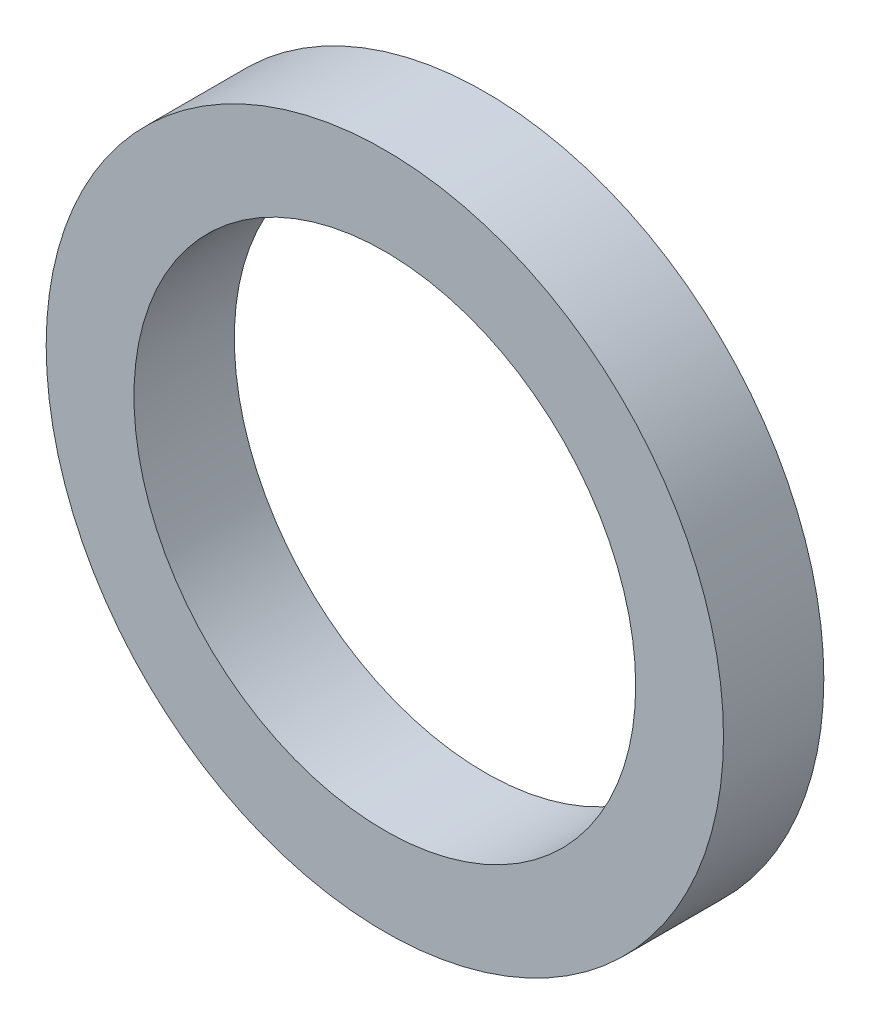
ISO-10303-21;
HEADER;
FILE_DESCRIPTION(('STEP AP214'),'2;1');
FILE_NAME('part.step','',(''),(''),'','','');
FILE_SCHEMA(('AUTOMOTIVE_DESIGN { 1 0 10303 214 1 1 1 1 }'));
ENDSEC;
DATA;
#1=APPLICATION_CONTEXT('core data for automotive mechanical design processes');
#2=APPLICATION_PROTOCOL_DEFINITION('international standard','automotive_design',2000,#1);
#3=PRODUCT_CONTEXT('',#1,'mechanical');
#4=PRODUCT('Part','Part','',(#3));
#5=PRODUCT_RELATED_PRODUCT_CATEGORY('part','',(#4));
#6=PRODUCT_DEFINITION_FORMATION('','',#4);
#7=PRODUCT_DEFINITION_CONTEXT('part definition',#1,'design');
#8=PRODUCT_DEFINITION('design','',#6,#7);
#9=PRODUCT_DEFINITION_SHAPE('','',#8);
#10=(LENGTH_UNIT() NAMED_UNIT(*) SI_UNIT(.MILLI.,.METRE.));
#11=(NAMED_UNIT(*) PLANE_ANGLE_UNIT() SI_UNIT($,.RADIAN.));
#12=(NAMED_UNIT(*) SI_UNIT($,.STERADIAN.) SOLID_ANGLE_UNIT());
#13=UNCERTAINTY_MEASURE_WITH_UNIT(LENGTH_MEASURE(1.E-05),#10,'distance_accuracy_value','');
#14=(GEOMETRIC_REPRESENTATION_CONTEXT(3) GLOBAL_UNCERTAINTY_ASSIGNED_CONTEXT((#13)) GLOBAL_UNIT_ASSIGNED_CONTEXT((#10,
#11,#12)) REPRESENTATION_CONTEXT('',''));
#15=CARTESIAN_POINT('',(0.,0.,0.));
#16=DIRECTION('',(0.,0.,1.));
#17=DIRECTION('',(1.,0.,0.));
#18=AXIS2_PLACEMENT_3D('',#15,#16,#17);
#19=CARTESIAN_POINT('',(0.,0.,4.));
#20=DIRECTION('',(0.,0.,1.));
#21=DIRECTION('',(1.,0.,0.));
#22=AXIS2_PLACEMENT_3D('',#19,#20,#21);
#23=PLANE('',#22);
#24=CARTESIAN_POINT('',(0.,0.,4.));
#25=DIRECTION('',(0.,0.,1.));
#26=DIRECTION('',(1.,0.,0.));
#27=AXIS2_PLACEMENT_3D('',#24,#25,#26);
#28=CIRCLE('',#27,13.5);
#29=CARTESIAN_POINT('',(13.5,0.,4.));
#30=VERTEX_POINT('',#29);
#31=EDGE_CURVE('E10',#30,#30,#28,.T.);
#32=ORIENTED_EDGE('',*,*,#31,.T.);
#33=EDGE_LOOP('',(#32));
#34=FACE_BOUND('',#33,.T.);
#35=CARTESIAN_POINT('',(0.,0.,4.));
#36=DIRECTION('',(0.,0.,1.));
#37=DIRECTION('',(1.,0.,0.));
#38=AXIS2_PLACEMENT_3D('',#35,#36,#37);
#39=CIRCLE('',#38,10.);
#40=CARTESIAN_POINT('',(10.,0.,4.));
#41=VERTEX_POINT('',#40);
#42=EDGE_CURVE('E50',#41,#41,#39,.T.);
#43=ORIENTED_EDGE('',*,*,#42,.F.);
#44=EDGE_LOOP('',(#43));
#45=FACE_BOUND('',#44,.T.);
#46=ADVANCED_FACE('F37',(#34,#45),#23,.T.);
#47=CARTESIAN_POINT('',(0.,0.,0.));
#48=DIRECTION('',(0.,0.,1.));
#49=DIRECTION('',(1.,0.,0.));
#50=AXIS2_PLACEMENT_3D('',#47,#48,#49);
#51=PLANE('',#50);
#52=CARTESIAN_POINT('',(0.,0.,0.));
#53=DIRECTION('',(0.,0.,1.));
#54=DIRECTION('',(1.,0.,0.));
#55=AXIS2_PLACEMENT_3D('',#52,#53,#54);
#56=CIRCLE('',#55,13.5);
#57=CARTESIAN_POINT('',(13.5,0.,0.));
#58=VERTEX_POINT('',#57);
#59=EDGE_CURVE('E41',#58,#58,#56,.T.);
#60=ORIENTED_EDGE('',*,*,#59,.F.);
#61=EDGE_LOOP('',(#60));
#62=FACE_BOUND('',#61,.T.);
#63=CARTESIAN_POINT('',(0.,0.,0.));
#64=DIRECTION('',(0.,0.,1.));
#65=DIRECTION('',(1.,0.,0.));
#66=AXIS2_PLACEMENT_3D('',#63,#64,#65);
#67=CIRCLE('',#66,10.);
#68=CARTESIAN_POINT('',(10.,0.,0.));
#69=VERTEX_POINT('',#68);
#70=EDGE_CURVE('E52',#69,#69,#67,.T.);
#71=ORIENTED_EDGE('',*,*,#70,.T.);
#72=EDGE_LOOP('',(#71));
#73=FACE_BOUND('',#72,.T.);
#74=ADVANCED_FACE('F64',(#62,#73),#51,.F.);
#75=CARTESIAN_POINT('',(0.,0.,4.));
#76=DIRECTION('',(0.,0.,-1.));
#77=DIRECTION('',(-1.,0.,0.));
#78=AXIS2_PLACEMENT_3D('',#75,#76,#77);
#79=CYLINDRICAL_SURFACE('',#78,13.5);
#80=ORIENTED_EDGE('',*,*,#31,.F.);
#81=EDGE_LOOP('',(#80));
#82=FACE_BOUND('',#81,.T.);
#83=ORIENTED_EDGE('',*,*,#59,.T.);
#84=EDGE_LOOP('',(#83));
#85=FACE_BOUND('',#84,.T.);
#86=ADVANCED_FACE('F39',(#82,#85),#79,.T.);
#87=CARTESIAN_POINT('',(0.,0.,4.));
#88=DIRECTION('',(0.,0.,-1.));
#89=DIRECTION('',(-1.,0.,0.));
#90=AXIS2_PLACEMENT_3D('',#87,#88,#89);
#91=CYLINDRICAL_SURFACE('',#90,10.);
#92=ORIENTED_EDGE('',*,*,#42,.T.);
#93=EDGE_LOOP('',(#92));
#94=FACE_BOUND('',#93,.T.);
#95=ORIENTED_EDGE('',*,*,#70,.F.);
#96=EDGE_LOOP('',(#95));
#97=FACE_BOUND('',#96,.T.);
#98=ADVANCED_FACE('F60',(#94,#97),#91,.F.);
#99=CLOSED_SHELL('',(#46,#74,#86,#98));
#100=MANIFOLD_SOLID_BREP('B2',#99);
#101=ADVANCED_BREP_SHAPE_REPRESENTATION('',(#18,#100),#14);
#102=SHAPE_DEFINITION_REPRESENTATION(#9,#101);
ENDSEC;
END-ISO-10303-21;
